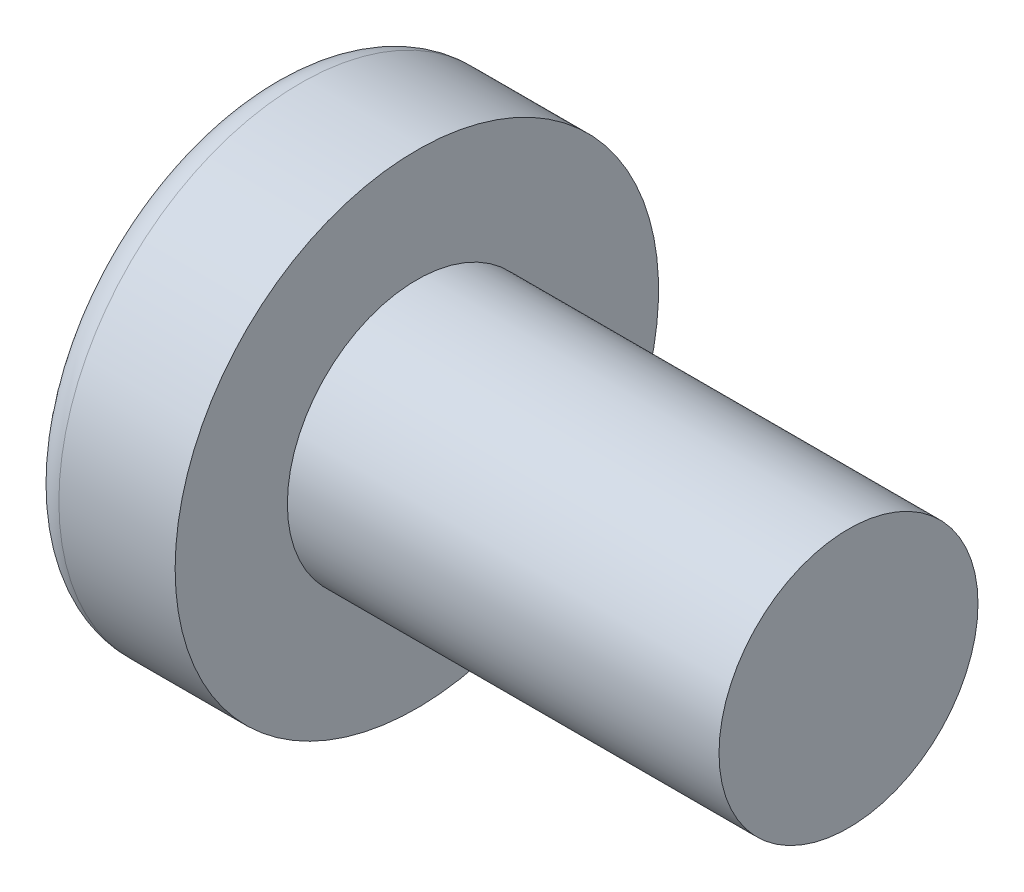
ISO-10303-21;
HEADER;
FILE_DESCRIPTION(('STEP AP214'),'2;1');
FILE_NAME('part.step','',(''),(''),'','','');
FILE_SCHEMA(('AUTOMOTIVE_DESIGN { 1 0 10303 214 1 1 1 1 }'));
ENDSEC;
DATA;
#1=APPLICATION_CONTEXT('core data for automotive mechanical design processes');
#2=APPLICATION_PROTOCOL_DEFINITION('international standard','automotive_design',2000,#1);
#3=PRODUCT_CONTEXT('',#1,'mechanical');
#4=PRODUCT('Part','Part','',(#3));
#5=PRODUCT_RELATED_PRODUCT_CATEGORY('part','',(#4));
#6=PRODUCT_DEFINITION_FORMATION('','',#4);
#7=PRODUCT_DEFINITION_CONTEXT('part definition',#1,'design');
#8=PRODUCT_DEFINITION('design','',#6,#7);
#9=PRODUCT_DEFINITION_SHAPE('','',#8);
#10=(LENGTH_UNIT() NAMED_UNIT(*) SI_UNIT(.MILLI.,.METRE.));
#11=(NAMED_UNIT(*) PLANE_ANGLE_UNIT() SI_UNIT($,.RADIAN.));
#12=(NAMED_UNIT(*) SI_UNIT($,.STERADIAN.) SOLID_ANGLE_UNIT());
#13=UNCERTAINTY_MEASURE_WITH_UNIT(LENGTH_MEASURE(1.E-05),#10,'distance_accuracy_value','');
#14=(GEOMETRIC_REPRESENTATION_CONTEXT(3) GLOBAL_UNCERTAINTY_ASSIGNED_CONTEXT((#13)) GLOBAL_UNIT_ASSIGNED_CONTEXT((#10,
#11,#12)) REPRESENTATION_CONTEXT('',''));
#15=CARTESIAN_POINT('',(0.,0.,0.));
#16=DIRECTION('',(0.,0.,1.));
#17=DIRECTION('',(1.,0.,0.));
#18=AXIS2_PLACEMENT_3D('',#15,#16,#17);
#19=CARTESIAN_POINT('',(2.01739130434783,0.,-0.15794466403162));
#20=DIRECTION('',(-0.104537710696287,0.,0.994520923380891));
#21=DIRECTION('',(0.994520923380891,0.,0.104537710696287));
#22=AXIS2_PLACEMENT_3D('',#19,#20,#21);
#23=PLANE('',#22);
#24=DIRECTION('',(-0.989130931836555,0.103971149085093,-0.103971149085093));
#25=VECTOR('',#24,1.);
#26=CARTESIAN_POINT('',(1.76,0.185000000000001,-0.184999999999999));
#27=LINE('',#26,#25);
#28=CARTESIAN_POINT('',(1.76,0.185,-0.184999999999999));
#29=VERTEX_POINT('',#28);
#30=CARTESIAN_POINT('',(0.0270341343313636,0.367158343834498,-0.367158343834493));
#31=VERTEX_POINT('',#30);
#32=EDGE_CURVE('E177',#29,#31,#27,.T.);
#33=ORIENTED_EDGE('',*,*,#32,.F.);
#34=DIRECTION('',(-0.80907355338853,0.581521616498006,-0.0850446632823175));
#35=VECTOR('',#34,1.);
#36=CARTESIAN_POINT('',(1.76,0.185,-0.185));
#37=LINE('',#36,#35);
#38=CARTESIAN_POINT('',(0.188596138461546,1.31444652548076,-0.350175974082167));
#39=VERTEX_POINT('',#38);
#40=EDGE_CURVE('E185',#29,#39,#37,.T.);
#41=ORIENTED_EDGE('',*,*,#40,.T.);
#42=CARTESIAN_POINT('',(0.188596138461547,1.31444652548076,-0.350175974082167));
#43=CARTESIAN_POINT('',(0.146535741725265,1.15917471210783,-0.354597095330013));
#44=CARTESIAN_POINT('',(0.112042043012943,1.00259812361751,-0.358222853433297));
#45=CARTESIAN_POINT('',(0.0581880416362154,0.686835396402088,-0.36388364335074));
#46=CARTESIAN_POINT('',(0.0388277389718106,0.527649257676991,-0.3659186751649));
#47=CARTESIAN_POINT('',(0.0270341343313647,0.367158343834508,-0.367158343834498));
#48=B_SPLINE_CURVE_WITH_KNOTS('',3,(#42,#43,#44,#45,#46,#47),.UNSPECIFIED.,.F.,.F.,(4,2,4),(0.,
0.481116103371659,0.962232206743319),.UNSPECIFIED.);
#49=EDGE_CURVE('E21',#39,#31,#48,.T.);
#50=ORIENTED_EDGE('',*,*,#49,.T.);
#51=EDGE_LOOP('',(#33,#41,#50));
#52=FACE_BOUND('',#51,.T.);
#53=ADVANCED_FACE('F17',(#52),#23,.T.);
#54=CARTESIAN_POINT('',(1.76,0.185,0.185));
#55=DIRECTION('',(0.583636048152575,0.812015371342714,0.));
#56=DIRECTION('',(-0.812015371342714,0.583636048152575,0.));
#57=AXIS2_PLACEMENT_3D('',#54,#55,#56);
#58=PLANE('',#57);
#59=DIRECTION('',(0.,0.,1.));
#60=VECTOR('',#59,1.);
#61=CARTESIAN_POINT('',(1.76,0.185,0.185));
#62=LINE('',#61,#60);
#63=CARTESIAN_POINT('',(1.76,0.185,0.185));
#64=VERTEX_POINT('',#63);
#65=EDGE_CURVE('E85',#64,#29,#62,.F.);
#66=ORIENTED_EDGE('',*,*,#65,.F.);
#67=DIRECTION('',(0.80907355338853,-0.581521616498006,-0.0850446632823172));
#68=VECTOR('',#67,1.);
#69=CARTESIAN_POINT('',(0.188596138461545,1.31444652548076,0.350175974082167));
#70=LINE('',#69,#68);
#71=CARTESIAN_POINT('',(0.188596138461546,1.31444652548076,0.350175974082167));
#72=VERTEX_POINT('',#71);
#73=EDGE_CURVE('E173',#72,#64,#70,.T.);
#74=ORIENTED_EDGE('',*,*,#73,.F.);
#75=CARTESIAN_POINT('',(0.188596138461547,1.31444652548076,-0.350175974082167));
#76=CARTESIAN_POINT('',(0.181505092768451,1.31954321457259,-0.233450649388112));
#77=CARTESIAN_POINT('',(0.177959569921918,1.32209155911854,-0.116725324694057));
#78=CARTESIAN_POINT('',(0.177959569921975,1.32209155911866,0.116725324694055));
#79=CARTESIAN_POINT('',(0.181505092768566,1.31954321457284,0.233450649388112));
#80=CARTESIAN_POINT('',(0.188596138461719,1.31444652548113,0.350175974082168));
#81=B_SPLINE_CURVE_WITH_KNOTS('',3,(#75,#76,#77,#78,#79,#80),.UNSPECIFIED.,.F.,.F.,(4,2,4),(0.,
0.35042088401523,0.70084176803046),.UNSPECIFIED.);
#82=EDGE_CURVE('E78',#39,#72,#81,.T.);
#83=ORIENTED_EDGE('',*,*,#82,.F.);
#84=ORIENTED_EDGE('',*,*,#40,.F.);
#85=EDGE_LOOP('',(#66,#74,#83,#84));
#86=FACE_BOUND('',#85,.T.);
#87=ADVANCED_FACE('F284',(#86),#58,.F.);
#88=CARTESIAN_POINT('',(2.01739130434783,0.15794466403162,0.));
#89=DIRECTION('',(-0.104537710696287,-0.994520923380891,0.));
#90=DIRECTION('',(0.994520923380891,-0.104537710696287,0.));
#91=AXIS2_PLACEMENT_3D('',#88,#89,#90);
#92=PLANE('',#91);
#93=DIRECTION('',(0.80907355338853,-0.0850446632823192,0.581521616498006));
#94=VECTOR('',#93,1.);
#95=CARTESIAN_POINT('',(0.188596138461544,0.350175974082172,-1.31444652548076));
#96=LINE('',#95,#94);
#97=CARTESIAN_POINT('',(0.188596138461545,0.350175974082172,-1.31444652548076));
#98=VERTEX_POINT('',#97);
#99=EDGE_CURVE('E164',#98,#29,#96,.T.);
#100=ORIENTED_EDGE('',*,*,#99,.T.);
#101=ORIENTED_EDGE('',*,*,#32,.T.);
#102=CARTESIAN_POINT('',(0.0270341343313624,0.367158343834489,-0.367158343834488));
#103=CARTESIAN_POINT('',(0.0388277389718089,0.365918675164897,-0.527649257676975));
#104=CARTESIAN_POINT('',(0.058188041636214,0.363883643350741,-0.686835396402075));
#105=CARTESIAN_POINT('',(0.112042043012942,0.358222853433302,-1.0025981236175));
#106=CARTESIAN_POINT('',(0.146535741725264,0.354597095330019,-1.15917471210783));
#107=CARTESIAN_POINT('',(0.188596138461545,0.350175974082172,-1.31444652548076));
#108=B_SPLINE_CURVE_WITH_KNOTS('',3,(#102,#103,#104,#105,#106,#107),.UNSPECIFIED.,.F.,.F.,(4,2,
4),(0.,0.481116103371668,0.962232206743337),.UNSPECIFIED.);
#109=EDGE_CURVE('E182',#31,#98,#108,.T.);
#110=ORIENTED_EDGE('',*,*,#109,.T.);
#111=EDGE_LOOP('',(#100,#101,#110));
#112=FACE_BOUND('',#111,.T.);
#113=ADVANCED_FACE('F280',(#112),#92,.T.);
#114=CARTESIAN_POINT('',(2.01739130434783,0.,0.15794466403162));
#115=DIRECTION('',(-0.104537710696287,0.,-0.994520923380891));
#116=DIRECTION('',(-0.994520923380891,0.,0.104537710696287));
#117=AXIS2_PLACEMENT_3D('',#114,#115,#116);
#118=PLANE('',#117);
#119=DIRECTION('',(0.989130931836555,-0.103971149085092,-0.103971149085092));
#120=VECTOR('',#119,1.);
#121=CARTESIAN_POINT('',(0.0270341343313623,0.367158343834486,0.367158343834487));
#122=LINE('',#121,#120);
#123=CARTESIAN_POINT('',(0.0270341343313624,0.367158343834486,0.367158343834487));
#124=VERTEX_POINT('',#123);
#125=EDGE_CURVE('E158',#124,#64,#122,.T.);
#126=ORIENTED_EDGE('',*,*,#125,.F.);
#127=CARTESIAN_POINT('',(0.0270341343313624,0.367158343834486,0.367158343834487));
#128=CARTESIAN_POINT('',(0.0388277389718081,0.527649257676974,0.365918675164895));
#129=CARTESIAN_POINT('',(0.058188041636213,0.686835396402074,0.363883643350739));
#130=CARTESIAN_POINT('',(0.112042043012941,1.0025981236175,0.358222853433299));
#131=CARTESIAN_POINT('',(0.146535741725265,1.15917471210783,0.354597095330016));
#132=CARTESIAN_POINT('',(0.188596138461547,1.31444652548076,0.350175974082169));
#133=B_SPLINE_CURVE_WITH_KNOTS('',3,(#127,#128,#129,#130,#131,#132),.UNSPECIFIED.,.F.,.F.,(4,2,
4),(0.,0.48111610337167,0.96223220674334),.UNSPECIFIED.);
#134=EDGE_CURVE('E176',#124,#72,#133,.T.);
#135=ORIENTED_EDGE('',*,*,#134,.T.);
#136=ORIENTED_EDGE('',*,*,#73,.T.);
#137=EDGE_LOOP('',(#126,#135,#136));
#138=FACE_BOUND('',#137,.T.);
#139=ADVANCED_FACE('F275',(#138),#118,.T.);
#140=CARTESIAN_POINT('',(1.76,0.185000000000001,-0.184999999999999));
#141=DIRECTION('',(0.583636048152575,0.,-0.812015371342714));
#142=DIRECTION('',(-0.812015371342714,0.,-0.583636048152575));
#143=AXIS2_PLACEMENT_3D('',#140,#141,#142);
#144=PLANE('',#143);
#145=DIRECTION('',(0.,1.,0.));
#146=VECTOR('',#145,1.);
#147=CARTESIAN_POINT('',(1.76,0.185000000000001,-0.184999999999999));
#148=LINE('',#147,#146);
#149=CARTESIAN_POINT('',(1.76,-0.185,-0.185));
#150=VERTEX_POINT('',#149);
#151=EDGE_CURVE('E109',#29,#150,#148,.F.);
#152=ORIENTED_EDGE('',*,*,#151,.F.);
#153=ORIENTED_EDGE('',*,*,#99,.F.);
#154=CARTESIAN_POINT('',(0.188596138461545,-0.350175974082162,-1.31444652548077));
#155=CARTESIAN_POINT('',(0.181505092768444,-0.233450649388107,-1.31954321457268));
#156=CARTESIAN_POINT('',(0.177959569921893,-0.116725324694051,-1.32209155911864));
#157=CARTESIAN_POINT('',(0.177959569921893,0.116725324694061,-1.32209155911864));
#158=CARTESIAN_POINT('',(0.181505092768444,0.233450649388116,-1.31954321457268));
#159=CARTESIAN_POINT('',(0.188596138461545,0.350175974082172,-1.31444652548076));
#160=B_SPLINE_CURVE_WITH_KNOTS('',3,(#154,#155,#156,#157,#158,#159),.UNSPECIFIED.,.F.,.F.,(4,2,
4),(0.,0.350420884015233,0.700841768030466),.UNSPECIFIED.);
#161=CARTESIAN_POINT('',(0.188596138461546,-0.350175974082162,-1.31444652548077));
#162=VERTEX_POINT('',#161);
#163=EDGE_CURVE('E167',#162,#98,#160,.T.);
#164=ORIENTED_EDGE('',*,*,#163,.F.);
#165=DIRECTION('',(-0.80907355338853,-0.0850446632823149,-0.581521616498007));
#166=VECTOR('',#165,1.);
#167=CARTESIAN_POINT('',(1.76,-0.184999999999999,-0.185));
#168=LINE('',#167,#166);
#169=EDGE_CURVE('E152',#150,#162,#168,.T.);
#170=ORIENTED_EDGE('',*,*,#169,.F.);
#171=EDGE_LOOP('',(#152,#153,#164,#170));
#172=FACE_BOUND('',#171,.T.);
#173=ADVANCED_FACE('F272',(#172),#144,.F.);
#174=CARTESIAN_POINT('',(2.01739130434783,0.15794466403162,0.));
#175=DIRECTION('',(-0.104537710696287,-0.994520923380891,0.));
#176=DIRECTION('',(0.994520923380891,-0.104537710696287,0.));
#177=AXIS2_PLACEMENT_3D('',#174,#175,#176);
#178=PLANE('',#177);
#179=ORIENTED_EDGE('',*,*,#125,.T.);
#180=DIRECTION('',(-0.80907355338853,0.0850446632823148,0.581521616498006));
#181=VECTOR('',#180,1.);
#182=CARTESIAN_POINT('',(1.76,0.185,0.185));
#183=LINE('',#182,#181);
#184=CARTESIAN_POINT('',(0.188596138461545,0.350175974082162,1.31444652548076));
#185=VERTEX_POINT('',#184);
#186=EDGE_CURVE('E102',#64,#185,#183,.T.);
#187=ORIENTED_EDGE('',*,*,#186,.T.);
#188=CARTESIAN_POINT('',(0.188596138461545,0.350175974082162,1.31444652548076));
#189=CARTESIAN_POINT('',(0.146535741725264,0.35459709533001,1.15917471210783));
#190=CARTESIAN_POINT('',(0.112042043012941,0.358222853433295,1.0025981236175));
#191=CARTESIAN_POINT('',(0.0581880416362134,0.363883643350737,0.686835396402074));
#192=CARTESIAN_POINT('',(0.0388277389718085,0.365918675164894,0.527649257676974));
#193=CARTESIAN_POINT('',(0.0270341343313625,0.367158343834487,0.367158343834487));
#194=B_SPLINE_CURVE_WITH_KNOTS('',3,(#188,#189,#190,#191,#192,#193),.UNSPECIFIED.,.F.,.F.,(4,2,
4),(0.,0.481116103371669,0.962232206743339),.UNSPECIFIED.);
#195=EDGE_CURVE('E161',#185,#124,#194,.T.);
#196=ORIENTED_EDGE('',*,*,#195,.T.);
#197=EDGE_LOOP('',(#179,#187,#196));
#198=FACE_BOUND('',#197,.T.);
#199=ADVANCED_FACE('F250',(#198),#178,.T.);
#200=CARTESIAN_POINT('',(2.01739130434783,-0.15794466403162,0.));
#201=DIRECTION('',(-0.104537710696287,0.994520923380891,0.));
#202=DIRECTION('',(-0.994520923380891,-0.104537710696287,0.));
#203=AXIS2_PLACEMENT_3D('',#200,#201,#202);
#204=PLANE('',#203);
#205=DIRECTION('',(-0.989130931836555,-0.103971149085092,-0.103971149085092));
#206=VECTOR('',#205,1.);
#207=CARTESIAN_POINT('',(1.76,-0.185,-0.185));
#208=LINE('',#207,#206);
#209=CARTESIAN_POINT('',(0.0270341343313625,-0.367158343834486,-0.367158343834489));
#210=VERTEX_POINT('',#209);
#211=EDGE_CURVE('E143',#150,#210,#208,.T.);
#212=ORIENTED_EDGE('',*,*,#211,.F.);
#213=ORIENTED_EDGE('',*,*,#169,.T.);
#214=CARTESIAN_POINT('',(0.188596138461547,-0.350175974082162,-1.31444652548077));
#215=CARTESIAN_POINT('',(0.146535741725264,-0.354597095330011,-1.15917471210783));
#216=CARTESIAN_POINT('',(0.112042043012941,-0.358222853433295,-1.0025981236175));
#217=CARTESIAN_POINT('',(0.0581880416362128,-0.363883643350736,-0.686835396402077));
#218=CARTESIAN_POINT('',(0.038827738971808,-0.365918675164893,-0.527649257676976));
#219=CARTESIAN_POINT('',(0.0270341343313624,-0.367158343834485,-0.367158343834488));
#220=B_SPLINE_CURVE_WITH_KNOTS('',3,(#214,#215,#216,#217,#218,#219),.UNSPECIFIED.,.F.,.F.,(4,2,
4),(0.,0.481116103371671,0.962232206743341),.UNSPECIFIED.);
#221=EDGE_CURVE('E155',#162,#210,#220,.T.);
#222=ORIENTED_EDGE('',*,*,#221,.T.);
#223=EDGE_LOOP('',(#212,#213,#222));
#224=FACE_BOUND('',#223,.T.);
#225=ADVANCED_FACE('F246',(#224),#204,.T.);
#226=CARTESIAN_POINT('',(1.76,-0.185000000000001,0.184999999999999));
#227=DIRECTION('',(0.583636048152575,0.,0.812015371342714));
#228=DIRECTION('',(0.812015371342714,0.,-0.583636048152575));
#229=AXIS2_PLACEMENT_3D('',#226,#227,#228);
#230=PLANE('',#229);
#231=DIRECTION('',(0.,1.,0.));
#232=VECTOR('',#231,1.);
#233=CARTESIAN_POINT('',(1.76,0.185,0.184999999999999));
#234=LINE('',#233,#232);
#235=CARTESIAN_POINT('',(1.76,-0.185,0.185));
#236=VERTEX_POINT('',#235);
#237=EDGE_CURVE('E94',#236,#64,#234,.T.);
#238=ORIENTED_EDGE('',*,*,#237,.F.);
#239=DIRECTION('',(0.80907355338853,0.0850446632823192,-0.581521616498005));
#240=VECTOR('',#239,1.);
#241=CARTESIAN_POINT('',(0.188596138461545,-0.350175974082172,1.31444652548076));
#242=LINE('',#241,#240);
#243=CARTESIAN_POINT('',(0.188596138461545,-0.350175974082171,1.31444652548076));
#244=VERTEX_POINT('',#243);
#245=EDGE_CURVE('E99',#244,#236,#242,.T.);
#246=ORIENTED_EDGE('',*,*,#245,.F.);
#247=CARTESIAN_POINT('',(0.188596138461545,0.350175974082162,1.31444652548077));
#248=CARTESIAN_POINT('',(0.181505092768445,0.233450649388107,1.31954321457268));
#249=CARTESIAN_POINT('',(0.177959569921894,0.116725324694051,1.32209155911864));
#250=CARTESIAN_POINT('',(0.177959569921894,-0.11672532469406,1.32209155911864));
#251=CARTESIAN_POINT('',(0.181505092768444,-0.233450649388116,1.31954321457268));
#252=CARTESIAN_POINT('',(0.188596138461545,-0.350175974082171,1.31444652548076));
#253=B_SPLINE_CURVE_WITH_KNOTS('',3,(#247,#248,#249,#250,#251,#252),.UNSPECIFIED.,.F.,.F.,(4,2,
4),(0.,0.350420884015233,0.700841768030465),.UNSPECIFIED.);
#254=EDGE_CURVE('E149',#185,#244,#253,.T.);
#255=ORIENTED_EDGE('',*,*,#254,.F.);
#256=ORIENTED_EDGE('',*,*,#186,.F.);
#257=EDGE_LOOP('',(#238,#246,#255,#256));
#258=FACE_BOUND('',#257,.T.);
#259=ADVANCED_FACE('F96',(#258),#230,.F.);
#260=CARTESIAN_POINT('',(2.01739130434783,0.,-0.15794466403162));
#261=DIRECTION('',(-0.104537710696287,0.,0.994520923380891));
#262=DIRECTION('',(0.994520923380891,0.,0.104537710696287));
#263=AXIS2_PLACEMENT_3D('',#260,#261,#262);
#264=PLANE('',#263);
#265=ORIENTED_EDGE('',*,*,#211,.T.);
#266=CARTESIAN_POINT('',(0.0270341343313625,-0.367158343834487,-0.367158343834489));
#267=CARTESIAN_POINT('',(0.0388277389718088,-0.527649257676974,-0.365918675164896));
#268=CARTESIAN_POINT('',(0.0581880416362139,-0.686835396402074,-0.363883643350739));
#269=CARTESIAN_POINT('',(0.112042043012942,-1.0025981236175,-0.358222853433299));
#270=CARTESIAN_POINT('',(0.146535741725265,-1.15917471210783,-0.354597095330015));
#271=CARTESIAN_POINT('',(0.188596138461547,-1.31444652548076,-0.350175974082167));
#272=B_SPLINE_CURVE_WITH_KNOTS('',3,(#266,#267,#268,#269,#270,#271),.UNSPECIFIED.,.F.,.F.,(4,2,
4),(0.,0.48111610337167,0.96223220674334),.UNSPECIFIED.);
#273=CARTESIAN_POINT('',(0.188596138461547,-1.31444652548076,-0.350175974082167));
#274=VERTEX_POINT('',#273);
#275=EDGE_CURVE('E104',#210,#274,#272,.T.);
#276=ORIENTED_EDGE('',*,*,#275,.T.);
#277=DIRECTION('',(0.80907355338853,0.581521616498006,0.0850446632823172));
#278=VECTOR('',#277,1.);
#279=CARTESIAN_POINT('',(0.188596138461544,-1.31444652548076,-0.350175974082167));
#280=LINE('',#279,#278);
#281=EDGE_CURVE('E112',#274,#150,#280,.T.);
#282=ORIENTED_EDGE('',*,*,#281,.T.);
#283=EDGE_LOOP('',(#265,#276,#282));
#284=FACE_BOUND('',#283,.T.);
#285=ADVANCED_FACE('F239',(#284),#264,.T.);
#286=CARTESIAN_POINT('',(1.76,0.185,-0.185));
#287=DIRECTION('',(-1.,0.,0.));
#288=DIRECTION('',(0.,0.,1.));
#289=AXIS2_PLACEMENT_3D('',#286,#287,#288);
#290=PLANE('',#289);
#291=ORIENTED_EDGE('',*,*,#237,.T.);
#292=ORIENTED_EDGE('',*,*,#65,.T.);
#293=ORIENTED_EDGE('',*,*,#151,.T.);
#294=DIRECTION('',(0.,0.,1.));
#295=VECTOR('',#294,1.);
#296=CARTESIAN_POINT('',(1.76,-0.185,-0.185));
#297=LINE('',#296,#295);
#298=EDGE_CURVE('E107',#150,#236,#297,.T.);
#299=ORIENTED_EDGE('',*,*,#298,.T.);
#300=EDGE_LOOP('',(#291,#292,#293,#299));
#301=FACE_BOUND('',#300,.T.);
#302=ADVANCED_FACE('F108',(#301),#290,.T.);
#303=CARTESIAN_POINT('',(2.01739130434783,-0.15794466403162,0.));
#304=DIRECTION('',(-0.104537710696287,0.994520923380891,0.));
#305=DIRECTION('',(-0.994520923380891,-0.104537710696287,0.));
#306=AXIS2_PLACEMENT_3D('',#303,#304,#305);
#307=PLANE('',#306);
#308=ORIENTED_EDGE('',*,*,#245,.T.);
#309=DIRECTION('',(0.989130931836555,0.103971149085093,-0.103971149085092));
#310=VECTOR('',#309,1.);
#311=CARTESIAN_POINT('',(0.0270341343313611,-0.367158343834489,0.367158343834487));
#312=LINE('',#311,#310);
#313=CARTESIAN_POINT('',(0.0270341343313618,-0.367158343834489,0.367158343834487));
#314=VERTEX_POINT('',#313);
#315=EDGE_CURVE('E111',#314,#236,#312,.T.);
#316=ORIENTED_EDGE('',*,*,#315,.F.);
#317=CARTESIAN_POINT('',(0.0270341343313624,-0.367158343834489,0.367158343834487));
#318=CARTESIAN_POINT('',(0.0388277389718078,-0.365918675164897,0.527649257676974));
#319=CARTESIAN_POINT('',(0.0581880416362125,-0.363883643350742,0.686835396402074));
#320=CARTESIAN_POINT('',(0.11204204301294,-0.358222853433302,1.0025981236175));
#321=CARTESIAN_POINT('',(0.146535741725263,-0.354597095330018,1.15917471210782));
#322=CARTESIAN_POINT('',(0.188596138461545,-0.350175974082171,1.31444652548076));
#323=B_SPLINE_CURVE_WITH_KNOTS('',3,(#317,#318,#319,#320,#321,#322),.UNSPECIFIED.,.F.,.F.,(4,2,
4),(0.,0.481116103371669,0.962232206743337),.UNSPECIFIED.);
#324=EDGE_CURVE('E103',#314,#244,#323,.T.);
#325=ORIENTED_EDGE('',*,*,#324,.T.);
#326=EDGE_LOOP('',(#308,#316,#325));
#327=FACE_BOUND('',#326,.T.);
#328=ADVANCED_FACE('F116',(#327),#307,.T.);
#329=CARTESIAN_POINT('',(1.76,-0.185,-0.185));
#330=DIRECTION('',(0.583636048152575,-0.812015371342714,0.));
#331=DIRECTION('',(0.812015371342714,0.583636048152575,0.));
#332=AXIS2_PLACEMENT_3D('',#329,#330,#331);
#333=PLANE('',#332);
#334=ORIENTED_EDGE('',*,*,#298,.F.);
#335=ORIENTED_EDGE('',*,*,#281,.F.);
#336=CARTESIAN_POINT('',(0.188596138461547,-1.31444652548076,0.350175974082166));
#337=CARTESIAN_POINT('',(0.181505092768451,-1.31954321457259,0.233450649388111));
#338=CARTESIAN_POINT('',(0.177959569921918,-1.32209155911854,0.116725324694055));
#339=CARTESIAN_POINT('',(0.177959569921975,-1.32209155911866,-0.116725324694056));
#340=CARTESIAN_POINT('',(0.181505092768566,-1.31954321457284,-0.233450649388113));
#341=CARTESIAN_POINT('',(0.188596138461719,-1.31444652548113,-0.35017597408217));
#342=B_SPLINE_CURVE_WITH_KNOTS('',3,(#336,#337,#338,#339,#340,#341),.UNSPECIFIED.,.F.,.F.,(4,2,
4),(0.,0.35042088401523,0.70084176803046),.UNSPECIFIED.);
#343=CARTESIAN_POINT('',(0.188596138461546,-1.31444652548076,0.350175974082166));
#344=VERTEX_POINT('',#343);
#345=EDGE_CURVE('E40',#344,#274,#342,.T.);
#346=ORIENTED_EDGE('',*,*,#345,.F.);
#347=DIRECTION('',(-0.80907355338853,-0.581521616498006,0.085044663282317));
#348=VECTOR('',#347,1.);
#349=CARTESIAN_POINT('',(1.76,-0.185000000000001,0.185));
#350=LINE('',#349,#348);
#351=EDGE_CURVE('E120',#236,#344,#350,.T.);
#352=ORIENTED_EDGE('',*,*,#351,.F.);
#353=EDGE_LOOP('',(#334,#335,#346,#352));
#354=FACE_BOUND('',#353,.T.);
#355=ADVANCED_FACE('F121',(#354),#333,.F.);
#356=CARTESIAN_POINT('',(2.01739130434783,0.,0.15794466403162));
#357=DIRECTION('',(-0.104537710696287,0.,-0.994520923380891));
#358=DIRECTION('',(-0.994520923380891,0.,0.104537710696287));
#359=AXIS2_PLACEMENT_3D('',#356,#357,#358);
#360=PLANE('',#359);
#361=ORIENTED_EDGE('',*,*,#315,.T.);
#362=ORIENTED_EDGE('',*,*,#351,.T.);
#363=CARTESIAN_POINT('',(0.0270341343313624,-0.367158343834489,0.367158343834487));
#364=CARTESIAN_POINT('',(0.0388277389718087,-0.527649257676976,0.365918675164895));
#365=CARTESIAN_POINT('',(0.0581880416362139,-0.686835396402076,0.363883643350739));
#366=CARTESIAN_POINT('',(0.112042043012942,-1.0025981236175,0.358222853433298));
#367=CARTESIAN_POINT('',(0.146535741725265,-1.15917471210783,0.354597095330014));
#368=CARTESIAN_POINT('',(0.188596138461547,-1.31444652548076,0.350175974082166));
#369=B_SPLINE_CURVE_WITH_KNOTS('',3,(#363,#364,#365,#366,#367,#368),.UNSPECIFIED.,.F.,.F.,(4,2,
4),(0.,0.481116103371669,0.962232206743339),.UNSPECIFIED.);
#370=EDGE_CURVE('E124',#314,#344,#369,.T.);
#371=ORIENTED_EDGE('',*,*,#370,.F.);
#372=EDGE_LOOP('',(#361,#362,#371));
#373=FACE_BOUND('',#372,.T.);
#374=ADVANCED_FACE('F126',(#373),#360,.T.);
#375=CARTESIAN_POINT('',(5.,0.,0.));
#376=DIRECTION('',(0.,1.,0.));
#377=DIRECTION('',(1.,0.,0.));
#378=AXIS2_PLACEMENT_3D('',#375,#376,#377);
#379=SPHERICAL_SURFACE('',#378,5.);
#380=CARTESIAN_POINT('',(0.747150706810474,0.,0.));
#381=DIRECTION('',(-1.,0.,0.));
#382=DIRECTION('',(0.,0.,1.));
#383=AXIS2_PLACEMENT_3D('',#380,#381,#382);
#384=CIRCLE('',#383,2.62931034482758);
#385=CARTESIAN_POINT('',(0.747150706810474,0.,2.62931034482758));
#386=VERTEX_POINT('',#385);
#387=EDGE_CURVE('E199',#386,#386,#384,.F.);
#388=ORIENTED_EDGE('',*,*,#387,.F.);
#389=EDGE_LOOP('',(#388));
#390=FACE_BOUND('',#389,.T.);
#391=ORIENTED_EDGE('',*,*,#370,.T.);
#392=ORIENTED_EDGE('',*,*,#345,.T.);
#393=ORIENTED_EDGE('',*,*,#275,.F.);
#394=ORIENTED_EDGE('',*,*,#221,.F.);
#395=ORIENTED_EDGE('',*,*,#163,.T.);
#396=ORIENTED_EDGE('',*,*,#109,.F.);
#397=ORIENTED_EDGE('',*,*,#49,.F.);
#398=ORIENTED_EDGE('',*,*,#82,.T.);
#399=ORIENTED_EDGE('',*,*,#134,.F.);
#400=ORIENTED_EDGE('',*,*,#195,.F.);
#401=ORIENTED_EDGE('',*,*,#254,.T.);
#402=ORIENTED_EDGE('',*,*,#324,.F.);
#403=EDGE_LOOP('',(#391,#392,#393,#394,#395,#396,#397,#398,#399,#400,#401,#402));
#404=FACE_BOUND('',#403,.T.);
#405=ADVANCED_FACE('F212',(#390,#404),#379,.T.);
#406=CARTESIAN_POINT('',(1.05335585592012,0.,0.));
#407=DIRECTION('',(-1.,0.,0.));
#408=DIRECTION('',(0.,0.,1.));
#409=AXIS2_PLACEMENT_3D('',#406,#407,#408);
#410=TOROIDAL_SURFACE('',#409,2.44,0.360000000000001);
#411=ORIENTED_EDGE('',*,*,#387,.T.);
#412=EDGE_LOOP('',(#411));
#413=FACE_BOUND('',#412,.T.);
#414=CARTESIAN_POINT('',(1.05335585592012,0.,0.));
#415=DIRECTION('',(-1.,0.,0.));
#416=DIRECTION('',(0.,0.,1.));
#417=AXIS2_PLACEMENT_3D('',#414,#415,#416);
#418=CIRCLE('',#417,2.8);
#419=CARTESIAN_POINT('',(1.05335585592012,0.,2.8));
#420=VERTEX_POINT('',#419);
#421=EDGE_CURVE('E198',#420,#420,#418,.F.);
#422=ORIENTED_EDGE('',*,*,#421,.F.);
#423=EDGE_LOOP('',(#422));
#424=FACE_BOUND('',#423,.T.);
#425=ADVANCED_FACE('F328',(#413,#424),#410,.T.);
#426=CARTESIAN_POINT('',(-25.4,0.,0.));
#427=DIRECTION('',(-1.,0.,0.));
#428=DIRECTION('',(0.,0.,1.));
#429=AXIS2_PLACEMENT_3D('',#426,#427,#428);
#430=CYLINDRICAL_SURFACE('',#429,2.8);
#431=ORIENTED_EDGE('',*,*,#421,.T.);
#432=EDGE_LOOP('',(#431));
#433=FACE_BOUND('',#432,.T.);
#434=CARTESIAN_POINT('',(2.4,0.,0.));
#435=DIRECTION('',(-1.,0.,0.));
#436=DIRECTION('',(0.,0.,1.));
#437=AXIS2_PLACEMENT_3D('',#434,#435,#436);
#438=CIRCLE('',#437,2.8);
#439=CARTESIAN_POINT('',(2.4,0.,2.8));
#440=VERTEX_POINT('',#439);
#441=EDGE_CURVE('E195',#440,#440,#438,.T.);
#442=ORIENTED_EDGE('',*,*,#441,.T.);
#443=EDGE_LOOP('',(#442));
#444=FACE_BOUND('',#443,.T.);
#445=ADVANCED_FACE('F325',(#433,#444),#430,.T.);
#446=CARTESIAN_POINT('',(7.4,1.5,0.));
#447=DIRECTION('',(1.,0.,0.));
#448=DIRECTION('',(0.,0.,-1.));
#449=AXIS2_PLACEMENT_3D('',#446,#447,#448);
#450=PLANE('',#449);
#451=CARTESIAN_POINT('',(7.4,0.,0.));
#452=DIRECTION('',(-1.,0.,0.));
#453=DIRECTION('',(0.,0.,1.));
#454=AXIS2_PLACEMENT_3D('',#451,#452,#453);
#455=CIRCLE('',#454,1.5);
#456=CARTESIAN_POINT('',(7.4,0.,1.5));
#457=VERTEX_POINT('',#456);
#458=EDGE_CURVE('E31',#457,#457,#455,.T.);
#459=ORIENTED_EDGE('',*,*,#458,.F.);
#460=EDGE_LOOP('',(#459));
#461=FACE_BOUND('',#460,.T.);
#462=ADVANCED_FACE('F318',(#461),#450,.T.);
#463=CARTESIAN_POINT('',(2.4,1.5,0.));
#464=DIRECTION('',(-1.,0.,0.));
#465=DIRECTION('',(0.,0.,1.));
#466=AXIS2_PLACEMENT_3D('',#463,#464,#465);
#467=PLANE('',#466);
#468=CARTESIAN_POINT('',(2.4,0.,0.));
#469=DIRECTION('',(-1.,0.,0.));
#470=DIRECTION('',(0.,0.,1.));
#471=AXIS2_PLACEMENT_3D('',#468,#469,#470);
#472=CIRCLE('',#471,1.5);
#473=CARTESIAN_POINT('',(2.4,0.,1.5));
#474=VERTEX_POINT('',#473);
#475=EDGE_CURVE('E11',#474,#474,#472,.F.);
#476=ORIENTED_EDGE('',*,*,#475,.F.);
#477=EDGE_LOOP('',(#476));
#478=FACE_BOUND('',#477,.T.);
#479=ORIENTED_EDGE('',*,*,#441,.F.);
#480=EDGE_LOOP('',(#479));
#481=FACE_BOUND('',#480,.T.);
#482=ADVANCED_FACE('F312',(#478,#481),#467,.F.);
#483=CARTESIAN_POINT('',(-25.4,0.,0.));
#484=DIRECTION('',(-1.,0.,0.));
#485=DIRECTION('',(0.,0.,1.));
#486=AXIS2_PLACEMENT_3D('',#483,#484,#485);
#487=CYLINDRICAL_SURFACE('',#486,1.5);
#488=ORIENTED_EDGE('',*,*,#475,.T.);
#489=EDGE_LOOP('',(#488));
#490=FACE_BOUND('',#489,.T.);
#491=ORIENTED_EDGE('',*,*,#458,.T.);
#492=EDGE_LOOP('',(#491));
#493=FACE_BOUND('',#492,.T.);
#494=ADVANCED_FACE('F310',(#490,#493),#487,.T.);
#495=CLOSED_SHELL('',(#53,#87,#113,#139,#173,#199,#225,#259,#285,#302,#328,#355,#374,#405,#425,
#445,#462,#482,#494));
#496=MANIFOLD_SOLID_BREP('B1',#495);
#497=ADVANCED_BREP_SHAPE_REPRESENTATION('',(#18,#496),#14);
#498=SHAPE_DEFINITION_REPRESENTATION(#9,#497);
ENDSEC;
END-ISO-10303-21;
